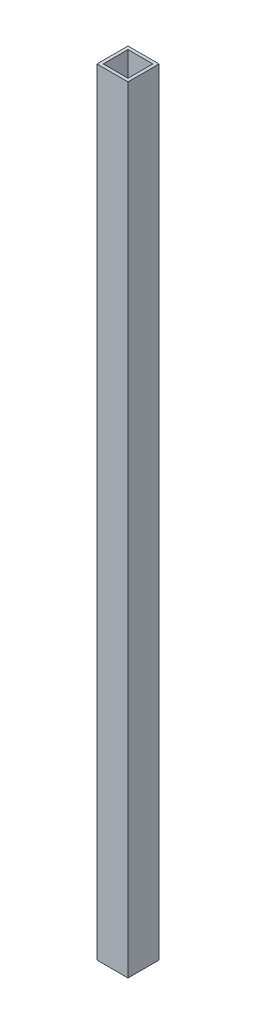
ISO-10303-21;
HEADER;
FILE_DESCRIPTION(('STEP AP214'),'2;1');
FILE_NAME('part.step','',(''),(''),'','','');
FILE_SCHEMA(('AUTOMOTIVE_DESIGN { 1 0 10303 214 1 1 1 1 }'));
ENDSEC;
DATA;
#1=APPLICATION_CONTEXT('core data for automotive mechanical design processes');
#2=APPLICATION_PROTOCOL_DEFINITION('international standard','automotive_design',2000,#1);
#3=PRODUCT_CONTEXT('',#1,'mechanical');
#4=PRODUCT('Part','Part','',(#3));
#5=PRODUCT_RELATED_PRODUCT_CATEGORY('part','',(#4));
#6=PRODUCT_DEFINITION_FORMATION('','',#4);
#7=PRODUCT_DEFINITION_CONTEXT('part definition',#1,'design');
#8=PRODUCT_DEFINITION('design','',#6,#7);
#9=PRODUCT_DEFINITION_SHAPE('','',#8);
#10=(LENGTH_UNIT() NAMED_UNIT(*) SI_UNIT(.MILLI.,.METRE.));
#11=(NAMED_UNIT(*) PLANE_ANGLE_UNIT() SI_UNIT($,.RADIAN.));
#12=(NAMED_UNIT(*) SI_UNIT($,.STERADIAN.) SOLID_ANGLE_UNIT());
#13=UNCERTAINTY_MEASURE_WITH_UNIT(LENGTH_MEASURE(1.E-05),#10,'distance_accuracy_value','');
#14=(GEOMETRIC_REPRESENTATION_CONTEXT(3) GLOBAL_UNCERTAINTY_ASSIGNED_CONTEXT((#13)) GLOBAL_UNIT_ASSIGNED_CONTEXT((#10,
#11,#12)) REPRESENTATION_CONTEXT('',''));
#15=CARTESIAN_POINT('',(0.,0.,0.));
#16=DIRECTION('',(0.,0.,1.));
#17=DIRECTION('',(1.,0.,0.));
#18=AXIS2_PLACEMENT_3D('',#15,#16,#17);
#19=CARTESIAN_POINT('',(0.,250.,0.));
#20=DIRECTION('',(0.,1.,0.));
#21=DIRECTION('',(0.,0.,1.));
#22=AXIS2_PLACEMENT_3D('',#19,#20,#21);
#23=PLANE('',#22);
#24=DIRECTION('',(0.,0.,1.));
#25=VECTOR('',#24,1.);
#26=CARTESIAN_POINT('',(-5.,250.,5.));
#27=LINE('',#26,#25);
#28=CARTESIAN_POINT('',(-5.,250.,-5.));
#29=VERTEX_POINT('',#28);
#30=CARTESIAN_POINT('',(-5.,250.,5.));
#31=VERTEX_POINT('',#30);
#32=EDGE_CURVE('E136',#29,#31,#27,.T.);
#33=ORIENTED_EDGE('',*,*,#32,.T.);
#34=DIRECTION('',(1.,0.,0.));
#35=VECTOR('',#34,1.);
#36=CARTESIAN_POINT('',(5.,250.,5.));
#37=LINE('',#36,#35);
#38=CARTESIAN_POINT('',(5.,250.,5.));
#39=VERTEX_POINT('',#38);
#40=EDGE_CURVE('E139',#31,#39,#37,.T.);
#41=ORIENTED_EDGE('',*,*,#40,.T.);
#42=DIRECTION('',(0.,0.,-1.));
#43=VECTOR('',#42,1.);
#44=CARTESIAN_POINT('',(5.,250.,5.));
#45=LINE('',#44,#43);
#46=CARTESIAN_POINT('',(5.,250.,-5.));
#47=VERTEX_POINT('',#46);
#48=EDGE_CURVE('E142',#39,#47,#45,.T.);
#49=ORIENTED_EDGE('',*,*,#48,.T.);
#50=DIRECTION('',(-1.,0.,0.));
#51=VECTOR('',#50,1.);
#52=CARTESIAN_POINT('',(5.,250.,-5.));
#53=LINE('',#52,#51);
#54=EDGE_CURVE('E144',#47,#29,#53,.T.);
#55=ORIENTED_EDGE('',*,*,#54,.T.);
#56=EDGE_LOOP('',(#33,#41,#49,#55));
#57=FACE_BOUND('',#56,.T.);
#58=DIRECTION('',(1.,0.,0.));
#59=VECTOR('',#58,1.);
#60=CARTESIAN_POINT('',(4.,250.,4.));
#61=LINE('',#60,#59);
#62=CARTESIAN_POINT('',(-4.,250.,4.));
#63=VERTEX_POINT('',#62);
#64=CARTESIAN_POINT('',(4.,250.,4.));
#65=VERTEX_POINT('',#64);
#66=EDGE_CURVE('E108',#63,#65,#61,.T.);
#67=ORIENTED_EDGE('',*,*,#66,.F.);
#68=DIRECTION('',(0.,0.,1.));
#69=VECTOR('',#68,1.);
#70=CARTESIAN_POINT('',(-4.,250.,4.));
#71=LINE('',#70,#69);
#72=CARTESIAN_POINT('',(-4.,250.,-4.));
#73=VERTEX_POINT('',#72);
#74=EDGE_CURVE('E100',#73,#63,#71,.T.);
#75=ORIENTED_EDGE('',*,*,#74,.F.);
#76=DIRECTION('',(-1.,0.,0.));
#77=VECTOR('',#76,1.);
#78=CARTESIAN_POINT('',(4.,250.,-4.));
#79=LINE('',#78,#77);
#80=CARTESIAN_POINT('',(4.,250.,-4.));
#81=VERTEX_POINT('',#80);
#82=EDGE_CURVE('E122',#81,#73,#79,.T.);
#83=ORIENTED_EDGE('',*,*,#82,.F.);
#84=DIRECTION('',(0.,0.,-1.));
#85=VECTOR('',#84,1.);
#86=CARTESIAN_POINT('',(4.,250.,4.));
#87=LINE('',#86,#85);
#88=EDGE_CURVE('E120',#65,#81,#87,.T.);
#89=ORIENTED_EDGE('',*,*,#88,.F.);
#90=EDGE_LOOP('',(#67,#75,#83,#89));
#91=FACE_BOUND('',#90,.T.);
#92=ADVANCED_FACE('F35',(#57,#91),#23,.T.);
#93=CARTESIAN_POINT('',(0.,0.,0.));
#94=DIRECTION('',(0.,1.,0.));
#95=DIRECTION('',(0.,0.,1.));
#96=AXIS2_PLACEMENT_3D('',#93,#94,#95);
#97=PLANE('',#96);
#98=DIRECTION('',(0.,0.,1.));
#99=VECTOR('',#98,1.);
#100=CARTESIAN_POINT('',(-5.,0.,5.));
#101=LINE('',#100,#99);
#102=CARTESIAN_POINT('',(-5.,0.,-5.));
#103=VERTEX_POINT('',#102);
#104=CARTESIAN_POINT('',(-5.,0.,5.));
#105=VERTEX_POINT('',#104);
#106=EDGE_CURVE('E116',#103,#105,#101,.T.);
#107=ORIENTED_EDGE('',*,*,#106,.F.);
#108=DIRECTION('',(-1.,0.,0.));
#109=VECTOR('',#108,1.);
#110=CARTESIAN_POINT('',(5.,0.,-5.));
#111=LINE('',#110,#109);
#112=CARTESIAN_POINT('',(5.,0.,-5.));
#113=VERTEX_POINT('',#112);
#114=EDGE_CURVE('E140',#113,#103,#111,.T.);
#115=ORIENTED_EDGE('',*,*,#114,.F.);
#116=DIRECTION('',(0.,0.,-1.));
#117=VECTOR('',#116,1.);
#118=CARTESIAN_POINT('',(5.,0.,5.));
#119=LINE('',#118,#117);
#120=CARTESIAN_POINT('',(5.,0.,5.));
#121=VERTEX_POINT('',#120);
#122=EDGE_CURVE('E151',#121,#113,#119,.T.);
#123=ORIENTED_EDGE('',*,*,#122,.F.);
#124=DIRECTION('',(1.,0.,0.));
#125=VECTOR('',#124,1.);
#126=CARTESIAN_POINT('',(5.,0.,5.));
#127=LINE('',#126,#125);
#128=EDGE_CURVE('E149',#105,#121,#127,.T.);
#129=ORIENTED_EDGE('',*,*,#128,.F.);
#130=EDGE_LOOP('',(#107,#115,#123,#129));
#131=FACE_BOUND('',#130,.T.);
#132=DIRECTION('',(0.,0.,1.));
#133=VECTOR('',#132,1.);
#134=CARTESIAN_POINT('',(-4.,0.,4.));
#135=LINE('',#134,#133);
#136=CARTESIAN_POINT('',(-4.,0.,-4.));
#137=VERTEX_POINT('',#136);
#138=CARTESIAN_POINT('',(-4.,0.,4.));
#139=VERTEX_POINT('',#138);
#140=EDGE_CURVE('E58',#137,#139,#135,.T.);
#141=ORIENTED_EDGE('',*,*,#140,.T.);
#142=DIRECTION('',(1.,0.,0.));
#143=VECTOR('',#142,1.);
#144=CARTESIAN_POINT('',(4.,0.,4.));
#145=LINE('',#144,#143);
#146=CARTESIAN_POINT('',(4.,0.,4.));
#147=VERTEX_POINT('',#146);
#148=EDGE_CURVE('E115',#139,#147,#145,.T.);
#149=ORIENTED_EDGE('',*,*,#148,.T.);
#150=DIRECTION('',(0.,0.,-1.));
#151=VECTOR('',#150,1.);
#152=CARTESIAN_POINT('',(4.,0.,4.));
#153=LINE('',#152,#151);
#154=CARTESIAN_POINT('',(4.,0.,-4.));
#155=VERTEX_POINT('',#154);
#156=EDGE_CURVE('E128',#147,#155,#153,.T.);
#157=ORIENTED_EDGE('',*,*,#156,.T.);
#158=DIRECTION('',(-1.,0.,0.));
#159=VECTOR('',#158,1.);
#160=CARTESIAN_POINT('',(4.,0.,-4.));
#161=LINE('',#160,#159);
#162=EDGE_CURVE('E109',#155,#137,#161,.T.);
#163=ORIENTED_EDGE('',*,*,#162,.T.);
#164=EDGE_LOOP('',(#141,#149,#157,#163));
#165=FACE_BOUND('',#164,.T.);
#166=ADVANCED_FACE('F169',(#131,#165),#97,.F.);
#167=CARTESIAN_POINT('',(-5.,250.,5.));
#168=DIRECTION('',(1.,0.,0.));
#169=DIRECTION('',(0.,0.,-1.));
#170=AXIS2_PLACEMENT_3D('',#167,#168,#169);
#171=PLANE('',#170);
#172=ORIENTED_EDGE('',*,*,#106,.T.);
#173=DIRECTION('',(0.,-1.,0.));
#174=VECTOR('',#173,1.);
#175=CARTESIAN_POINT('',(-5.,250.,5.));
#176=LINE('',#175,#174);
#177=EDGE_CURVE('E11',#31,#105,#176,.T.);
#178=ORIENTED_EDGE('',*,*,#177,.F.);
#179=ORIENTED_EDGE('',*,*,#32,.F.);
#180=DIRECTION('',(0.,-1.,0.));
#181=VECTOR('',#180,1.);
#182=CARTESIAN_POINT('',(-5.,250.,-5.));
#183=LINE('',#182,#181);
#184=EDGE_CURVE('E146',#29,#103,#183,.T.);
#185=ORIENTED_EDGE('',*,*,#184,.T.);
#186=EDGE_LOOP('',(#172,#178,#179,#185));
#187=FACE_BOUND('',#186,.T.);
#188=ADVANCED_FACE('F37',(#187),#171,.F.);
#189=CARTESIAN_POINT('',(5.,250.,5.));
#190=DIRECTION('',(0.,0.,-1.));
#191=DIRECTION('',(-1.,0.,0.));
#192=AXIS2_PLACEMENT_3D('',#189,#190,#191);
#193=PLANE('',#192);
#194=ORIENTED_EDGE('',*,*,#128,.T.);
#195=DIRECTION('',(0.,-1.,0.));
#196=VECTOR('',#195,1.);
#197=CARTESIAN_POINT('',(5.,250.,5.));
#198=LINE('',#197,#196);
#199=EDGE_CURVE('E43',#39,#121,#198,.T.);
#200=ORIENTED_EDGE('',*,*,#199,.F.);
#201=ORIENTED_EDGE('',*,*,#40,.F.);
#202=ORIENTED_EDGE('',*,*,#177,.T.);
#203=EDGE_LOOP('',(#194,#200,#201,#202));
#204=FACE_BOUND('',#203,.T.);
#205=ADVANCED_FACE('F179',(#204),#193,.F.);
#206=CARTESIAN_POINT('',(5.,250.,5.));
#207=DIRECTION('',(-1.,0.,0.));
#208=DIRECTION('',(0.,0.,1.));
#209=AXIS2_PLACEMENT_3D('',#206,#207,#208);
#210=PLANE('',#209);
#211=ORIENTED_EDGE('',*,*,#122,.T.);
#212=DIRECTION('',(0.,-1.,0.));
#213=VECTOR('',#212,1.);
#214=CARTESIAN_POINT('',(5.,250.,-5.));
#215=LINE('',#214,#213);
#216=EDGE_CURVE('E156',#47,#113,#215,.T.);
#217=ORIENTED_EDGE('',*,*,#216,.F.);
#218=ORIENTED_EDGE('',*,*,#48,.F.);
#219=ORIENTED_EDGE('',*,*,#199,.T.);
#220=EDGE_LOOP('',(#211,#217,#218,#219));
#221=FACE_BOUND('',#220,.T.);
#222=ADVANCED_FACE('F163',(#221),#210,.F.);
#223=CARTESIAN_POINT('',(5.,250.,-5.));
#224=DIRECTION('',(0.,0.,1.));
#225=DIRECTION('',(1.,0.,0.));
#226=AXIS2_PLACEMENT_3D('',#223,#224,#225);
#227=PLANE('',#226);
#228=ORIENTED_EDGE('',*,*,#114,.T.);
#229=ORIENTED_EDGE('',*,*,#184,.F.);
#230=ORIENTED_EDGE('',*,*,#54,.F.);
#231=ORIENTED_EDGE('',*,*,#216,.T.);
#232=EDGE_LOOP('',(#228,#229,#230,#231));
#233=FACE_BOUND('',#232,.T.);
#234=ADVANCED_FACE('F173',(#233),#227,.F.);
#235=CARTESIAN_POINT('',(-4.,250.,4.));
#236=DIRECTION('',(1.,0.,0.));
#237=DIRECTION('',(0.,0.,-1.));
#238=AXIS2_PLACEMENT_3D('',#235,#236,#237);
#239=PLANE('',#238);
#240=ORIENTED_EDGE('',*,*,#140,.F.);
#241=DIRECTION('',(0.,-1.,0.));
#242=VECTOR('',#241,1.);
#243=CARTESIAN_POINT('',(-4.,250.,-4.));
#244=LINE('',#243,#242);
#245=EDGE_CURVE('E104',#73,#137,#244,.T.);
#246=ORIENTED_EDGE('',*,*,#245,.F.);
#247=ORIENTED_EDGE('',*,*,#74,.T.);
#248=DIRECTION('',(0.,-1.,0.));
#249=VECTOR('',#248,1.);
#250=CARTESIAN_POINT('',(-4.,250.,4.));
#251=LINE('',#250,#249);
#252=EDGE_CURVE('E103',#63,#139,#251,.T.);
#253=ORIENTED_EDGE('',*,*,#252,.T.);
#254=EDGE_LOOP('',(#240,#246,#247,#253));
#255=FACE_BOUND('',#254,.T.);
#256=ADVANCED_FACE('F102',(#255),#239,.T.);
#257=CARTESIAN_POINT('',(4.,250.,4.));
#258=DIRECTION('',(0.,0.,-1.));
#259=DIRECTION('',(-1.,0.,0.));
#260=AXIS2_PLACEMENT_3D('',#257,#258,#259);
#261=PLANE('',#260);
#262=ORIENTED_EDGE('',*,*,#148,.F.);
#263=ORIENTED_EDGE('',*,*,#252,.F.);
#264=ORIENTED_EDGE('',*,*,#66,.T.);
#265=DIRECTION('',(0.,-1.,0.));
#266=VECTOR('',#265,1.);
#267=CARTESIAN_POINT('',(4.,250.,4.));
#268=LINE('',#267,#266);
#269=EDGE_CURVE('E117',#65,#147,#268,.T.);
#270=ORIENTED_EDGE('',*,*,#269,.T.);
#271=EDGE_LOOP('',(#262,#263,#264,#270));
#272=FACE_BOUND('',#271,.T.);
#273=ADVANCED_FACE('F112',(#272),#261,.T.);
#274=CARTESIAN_POINT('',(4.,250.,4.));
#275=DIRECTION('',(-1.,0.,0.));
#276=DIRECTION('',(0.,0.,1.));
#277=AXIS2_PLACEMENT_3D('',#274,#275,#276);
#278=PLANE('',#277);
#279=ORIENTED_EDGE('',*,*,#156,.F.);
#280=ORIENTED_EDGE('',*,*,#269,.F.);
#281=ORIENTED_EDGE('',*,*,#88,.T.);
#282=DIRECTION('',(0.,-1.,0.));
#283=VECTOR('',#282,1.);
#284=CARTESIAN_POINT('',(4.,250.,-4.));
#285=LINE('',#284,#283);
#286=EDGE_CURVE('E50',#81,#155,#285,.T.);
#287=ORIENTED_EDGE('',*,*,#286,.T.);
#288=EDGE_LOOP('',(#279,#280,#281,#287));
#289=FACE_BOUND('',#288,.T.);
#290=ADVANCED_FACE('F202',(#289),#278,.T.);
#291=CARTESIAN_POINT('',(4.,250.,-4.));
#292=DIRECTION('',(0.,0.,1.));
#293=DIRECTION('',(1.,0.,0.));
#294=AXIS2_PLACEMENT_3D('',#291,#292,#293);
#295=PLANE('',#294);
#296=ORIENTED_EDGE('',*,*,#162,.F.);
#297=ORIENTED_EDGE('',*,*,#286,.F.);
#298=ORIENTED_EDGE('',*,*,#82,.T.);
#299=ORIENTED_EDGE('',*,*,#245,.T.);
#300=EDGE_LOOP('',(#296,#297,#298,#299));
#301=FACE_BOUND('',#300,.T.);
#302=ADVANCED_FACE('F206',(#301),#295,.T.);
#303=CLOSED_SHELL('',(#92,#166,#188,#205,#222,#234,#256,#273,#290,#302));
#304=MANIFOLD_SOLID_BREP('B2',#303);
#305=ADVANCED_BREP_SHAPE_REPRESENTATION('',(#18,#304),#14);
#306=SHAPE_DEFINITION_REPRESENTATION(#9,#305);
ENDSEC;
END-ISO-10303-21;
